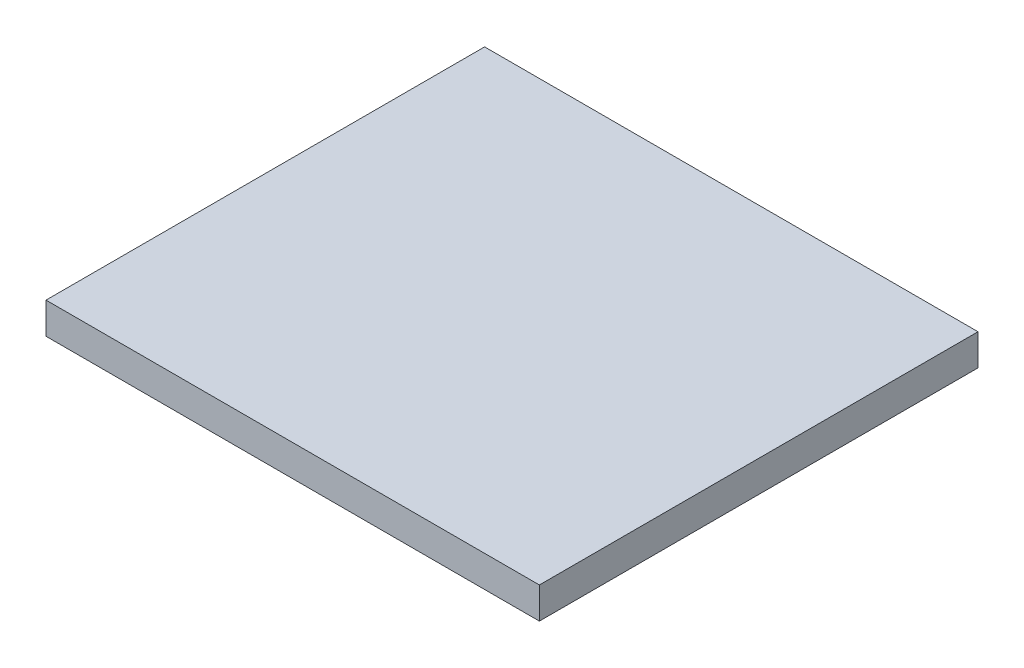
ISO-10303-21;
HEADER;
FILE_DESCRIPTION(('STEP AP214'),'2;1');
FILE_NAME('part.step','',(''),(''),'','','');
FILE_SCHEMA(('AUTOMOTIVE_DESIGN { 1 0 10303 214 1 1 1 1 }'));
ENDSEC;
DATA;
#1=APPLICATION_CONTEXT('core data for automotive mechanical design processes');
#2=APPLICATION_PROTOCOL_DEFINITION('international standard','automotive_design',2000,#1);
#3=PRODUCT_CONTEXT('',#1,'mechanical');
#4=PRODUCT('Part','Part','',(#3));
#5=PRODUCT_RELATED_PRODUCT_CATEGORY('part','',(#4));
#6=PRODUCT_DEFINITION_FORMATION('','',#4);
#7=PRODUCT_DEFINITION_CONTEXT('part definition',#1,'design');
#8=PRODUCT_DEFINITION('design','',#6,#7);
#9=PRODUCT_DEFINITION_SHAPE('','',#8);
#10=(LENGTH_UNIT() NAMED_UNIT(*) SI_UNIT(.MILLI.,.METRE.));
#11=(NAMED_UNIT(*) PLANE_ANGLE_UNIT() SI_UNIT($,.RADIAN.));
#12=(NAMED_UNIT(*) SI_UNIT($,.STERADIAN.) SOLID_ANGLE_UNIT());
#13=UNCERTAINTY_MEASURE_WITH_UNIT(LENGTH_MEASURE(1.E-05),#10,'distance_accuracy_value','');
#14=(GEOMETRIC_REPRESENTATION_CONTEXT(3) GLOBAL_UNCERTAINTY_ASSIGNED_CONTEXT((#13)) GLOBAL_UNIT_ASSIGNED_CONTEXT((#10,
#11,#12)) REPRESENTATION_CONTEXT('',''));
#15=CARTESIAN_POINT('',(0.,0.,0.));
#16=DIRECTION('',(0.,0.,1.));
#17=DIRECTION('',(1.,0.,0.));
#18=AXIS2_PLACEMENT_3D('',#15,#16,#17);
#19=CARTESIAN_POINT('',(-67.585,95.6500000000001,-127.004202423773));
#20=DIRECTION('',(0.,-1.,0.));
#21=DIRECTION('',(0.,0.,-1.));
#22=AXIS2_PLACEMENT_3D('',#19,#20,#21);
#23=PLANE('',#22);
#24=DIRECTION('',(0.,0.,1.));
#25=VECTOR('',#24,1.);
#26=CARTESIAN_POINT('',(-50.,95.6500000000001,0.));
#27=LINE('',#26,#25);
#28=CARTESIAN_POINT('',(-50.,95.6500000000001,-127.004202423773));
#29=VERTEX_POINT('',#28);
#30=CARTESIAN_POINT('',(-50.,95.6500000000001,-38.1042024237734));
#31=VERTEX_POINT('',#30);
#32=EDGE_CURVE('E90',#29,#31,#27,.T.);
#33=ORIENTED_EDGE('',*,*,#32,.F.);
#34=DIRECTION('',(1.,0.,0.));
#35=VECTOR('',#34,1.);
#36=CARTESIAN_POINT('',(-67.585,95.6500000000001,-127.004202423773));
#37=LINE('',#36,#35);
#38=CARTESIAN_POINT('',(50.,95.6500000000001,-127.004202423773));
#39=VERTEX_POINT('',#38);
#40=EDGE_CURVE('E45',#29,#39,#37,.T.);
#41=ORIENTED_EDGE('',*,*,#40,.T.);
#42=DIRECTION('',(0.,0.,1.));
#43=VECTOR('',#42,1.);
#44=CARTESIAN_POINT('',(50.,95.6500000000001,0.));
#45=LINE('',#44,#43);
#46=CARTESIAN_POINT('',(50.,95.6500000000001,-38.1042024237734));
#47=VERTEX_POINT('',#46);
#48=EDGE_CURVE('E94',#39,#47,#45,.T.);
#49=ORIENTED_EDGE('',*,*,#48,.T.);
#50=DIRECTION('',(1.,0.,0.));
#51=VECTOR('',#50,1.);
#52=CARTESIAN_POINT('',(-67.585,95.6500000000001,-38.1042024237734));
#53=LINE('',#52,#51);
#54=EDGE_CURVE('E11',#31,#47,#53,.T.);
#55=ORIENTED_EDGE('',*,*,#54,.F.);
#56=EDGE_LOOP('',(#33,#41,#49,#55));
#57=FACE_BOUND('',#56,.T.);
#58=ADVANCED_FACE('F36',(#57),#23,.T.);
#59=CARTESIAN_POINT('',(-67.585,102.,-127.004202423773));
#60=DIRECTION('',(0.,0.,-1.));
#61=DIRECTION('',(-1.,0.,0.));
#62=AXIS2_PLACEMENT_3D('',#59,#60,#61);
#63=PLANE('',#62);
#64=DIRECTION('',(0.,-1.,0.));
#65=VECTOR('',#64,1.);
#66=CARTESIAN_POINT('',(-50.,0.,-127.004202423773));
#67=LINE('',#66,#65);
#68=CARTESIAN_POINT('',(-50.,102.,-127.004202423773));
#69=VERTEX_POINT('',#68);
#70=EDGE_CURVE('E82',#69,#29,#67,.T.);
#71=ORIENTED_EDGE('',*,*,#70,.F.);
#72=DIRECTION('',(1.,0.,0.));
#73=VECTOR('',#72,1.);
#74=CARTESIAN_POINT('',(-50.01,102.,-127.004202423773));
#75=LINE('',#74,#73);
#76=CARTESIAN_POINT('',(50.,102.,-127.004202423773));
#77=VERTEX_POINT('',#76);
#78=EDGE_CURVE('E40',#69,#77,#75,.T.);
#79=ORIENTED_EDGE('',*,*,#78,.T.);
#80=DIRECTION('',(0.,-1.,0.));
#81=VECTOR('',#80,1.);
#82=CARTESIAN_POINT('',(50.,0.,-127.004202423773));
#83=LINE('',#82,#81);
#84=EDGE_CURVE('E80',#77,#39,#83,.T.);
#85=ORIENTED_EDGE('',*,*,#84,.T.);
#86=ORIENTED_EDGE('',*,*,#40,.F.);
#87=EDGE_LOOP('',(#71,#79,#85,#86));
#88=FACE_BOUND('',#87,.T.);
#89=ADVANCED_FACE('F78',(#88),#63,.T.);
#90=CARTESIAN_POINT('',(-67.585,102.,-38.1042024237734));
#91=DIRECTION('',(0.,0.,1.));
#92=DIRECTION('',(1.,0.,0.));
#93=AXIS2_PLACEMENT_3D('',#90,#91,#92);
#94=PLANE('',#93);
#95=DIRECTION('',(0.,1.,0.));
#96=VECTOR('',#95,1.);
#97=CARTESIAN_POINT('',(-50.,0.,-38.1042024237734));
#98=LINE('',#97,#96);
#99=CARTESIAN_POINT('',(-50.,102.,-38.1042024237733));
#100=VERTEX_POINT('',#99);
#101=EDGE_CURVE('E97',#31,#100,#98,.T.);
#102=ORIENTED_EDGE('',*,*,#101,.F.);
#103=ORIENTED_EDGE('',*,*,#54,.T.);
#104=DIRECTION('',(0.,1.,0.));
#105=VECTOR('',#104,1.);
#106=CARTESIAN_POINT('',(50.,0.,-38.1042024237734));
#107=LINE('',#106,#105);
#108=CARTESIAN_POINT('',(50.,102.,-38.1042024237733));
#109=VERTEX_POINT('',#108);
#110=EDGE_CURVE('E95',#47,#109,#107,.T.);
#111=ORIENTED_EDGE('',*,*,#110,.T.);
#112=DIRECTION('',(1.,0.,0.));
#113=VECTOR('',#112,1.);
#114=CARTESIAN_POINT('',(-50.01,102.,-38.1042024237733));
#115=LINE('',#114,#113);
#116=EDGE_CURVE('E53',#100,#109,#115,.T.);
#117=ORIENTED_EDGE('',*,*,#116,.F.);
#118=EDGE_LOOP('',(#102,#103,#111,#117));
#119=FACE_BOUND('',#118,.T.);
#120=ADVANCED_FACE('F104',(#119),#94,.T.);
#121=CARTESIAN_POINT('',(-50.,0.,0.));
#122=DIRECTION('',(-1.,0.,0.));
#123=DIRECTION('',(0.,0.,1.));
#124=AXIS2_PLACEMENT_3D('',#121,#122,#123);
#125=PLANE('',#124);
#126=DIRECTION('',(0.,0.,1.));
#127=VECTOR('',#126,1.);
#128=CARTESIAN_POINT('',(-50.,102.,-44.4542024237734));
#129=LINE('',#128,#127);
#130=EDGE_CURVE('E84',#69,#100,#129,.T.);
#131=ORIENTED_EDGE('',*,*,#130,.F.);
#132=ORIENTED_EDGE('',*,*,#70,.T.);
#133=ORIENTED_EDGE('',*,*,#32,.T.);
#134=ORIENTED_EDGE('',*,*,#101,.T.);
#135=EDGE_LOOP('',(#131,#132,#133,#134));
#136=FACE_BOUND('',#135,.T.);
#137=ADVANCED_FACE('F110',(#136),#125,.T.);
#138=CARTESIAN_POINT('',(-50.01,102.,-38.1042024237733));
#139=DIRECTION('',(0.,-1.,0.));
#140=DIRECTION('',(0.,0.,-1.));
#141=AXIS2_PLACEMENT_3D('',#138,#139,#140);
#142=PLANE('',#141);
#143=ORIENTED_EDGE('',*,*,#78,.F.);
#144=ORIENTED_EDGE('',*,*,#130,.T.);
#145=ORIENTED_EDGE('',*,*,#116,.T.);
#146=DIRECTION('',(0.,0.,1.));
#147=VECTOR('',#146,1.);
#148=CARTESIAN_POINT('',(50.,102.,-44.4542024237734));
#149=LINE('',#148,#147);
#150=EDGE_CURVE('E86',#77,#109,#149,.T.);
#151=ORIENTED_EDGE('',*,*,#150,.F.);
#152=EDGE_LOOP('',(#143,#144,#145,#151));
#153=FACE_BOUND('',#152,.T.);
#154=ADVANCED_FACE('F87',(#153),#142,.F.);
#155=CARTESIAN_POINT('',(50.,0.,0.));
#156=DIRECTION('',(-1.,0.,0.));
#157=DIRECTION('',(0.,0.,1.));
#158=AXIS2_PLACEMENT_3D('',#155,#156,#157);
#159=PLANE('',#158);
#160=ORIENTED_EDGE('',*,*,#84,.F.);
#161=ORIENTED_EDGE('',*,*,#150,.T.);
#162=ORIENTED_EDGE('',*,*,#110,.F.);
#163=ORIENTED_EDGE('',*,*,#48,.F.);
#164=EDGE_LOOP('',(#160,#161,#162,#163));
#165=FACE_BOUND('',#164,.T.);
#166=ADVANCED_FACE('F38',(#165),#159,.F.);
#167=CLOSED_SHELL('',(#58,#89,#120,#137,#154,#166));
#168=MANIFOLD_SOLID_BREP('B2',#167);
#169=ADVANCED_BREP_SHAPE_REPRESENTATION('',(#18,#168),#14);
#170=SHAPE_DEFINITION_REPRESENTATION(#9,#169);
ENDSEC;
END-ISO-10303-21;
